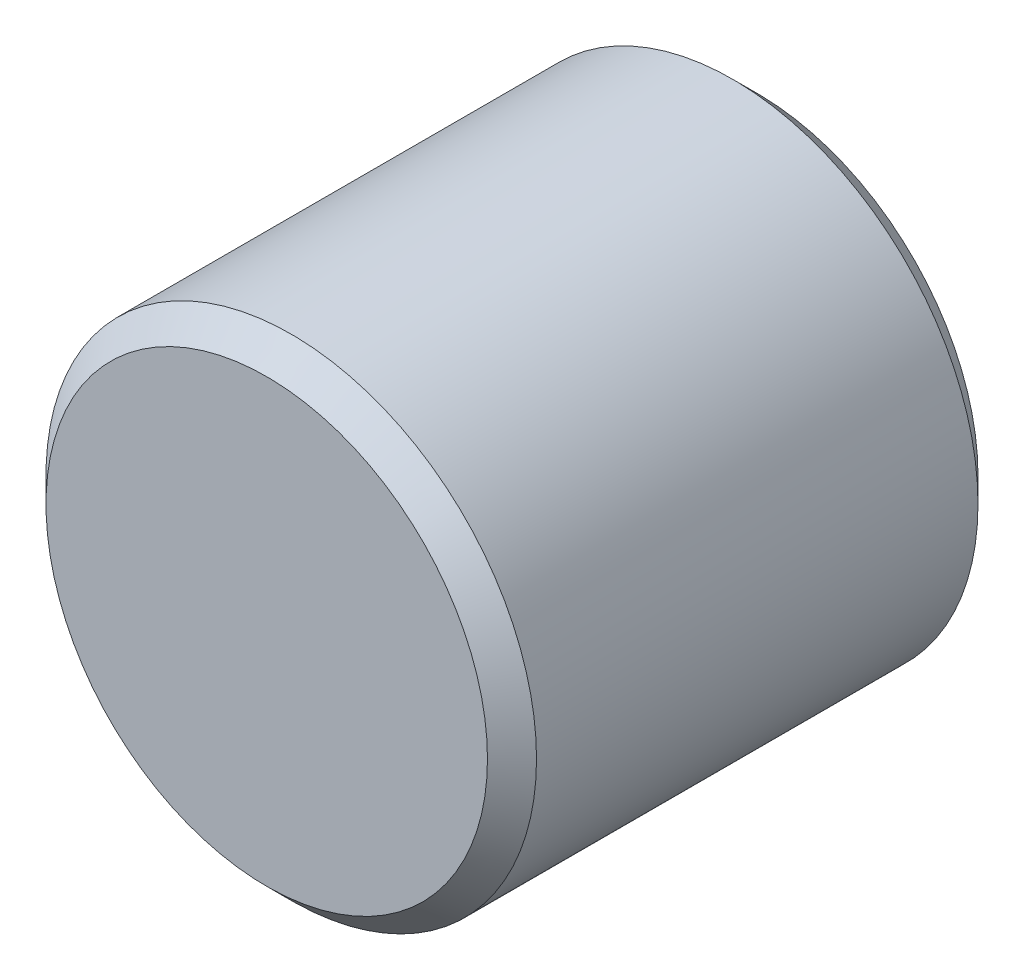
ISO-10303-21;
HEADER;
FILE_DESCRIPTION(('STEP AP214'),'2;1');
FILE_NAME('part.step','',(''),(''),'','','');
FILE_SCHEMA(('AUTOMOTIVE_DESIGN { 1 0 10303 214 1 1 1 1 }'));
ENDSEC;
DATA;
#1=APPLICATION_CONTEXT('core data for automotive mechanical design processes');
#2=APPLICATION_PROTOCOL_DEFINITION('international standard','automotive_design',2000,#1);
#3=PRODUCT_CONTEXT('',#1,'mechanical');
#4=PRODUCT('Part','Part','',(#3));
#5=PRODUCT_RELATED_PRODUCT_CATEGORY('part','',(#4));
#6=PRODUCT_DEFINITION_FORMATION('','',#4);
#7=PRODUCT_DEFINITION_CONTEXT('part definition',#1,'design');
#8=PRODUCT_DEFINITION('design','',#6,#7);
#9=PRODUCT_DEFINITION_SHAPE('','',#8);
#10=(LENGTH_UNIT() NAMED_UNIT(*) SI_UNIT(.MILLI.,.METRE.));
#11=(NAMED_UNIT(*) PLANE_ANGLE_UNIT() SI_UNIT($,.RADIAN.));
#12=(NAMED_UNIT(*) SI_UNIT($,.STERADIAN.) SOLID_ANGLE_UNIT());
#13=UNCERTAINTY_MEASURE_WITH_UNIT(LENGTH_MEASURE(1.E-05),#10,'distance_accuracy_value','');
#14=(GEOMETRIC_REPRESENTATION_CONTEXT(3) GLOBAL_UNCERTAINTY_ASSIGNED_CONTEXT((#13)) GLOBAL_UNIT_ASSIGNED_CONTEXT((#10,
#11,#12)) REPRESENTATION_CONTEXT('',''));
#15=CARTESIAN_POINT('',(0.,0.,0.));
#16=DIRECTION('',(0.,0.,1.));
#17=DIRECTION('',(1.,0.,0.));
#18=AXIS2_PLACEMENT_3D('',#15,#16,#17);
#19=CARTESIAN_POINT('',(0.,0.,2.54));
#20=DIRECTION('',(0.,0.,-1.));
#21=DIRECTION('',(-1.,0.,0.));
#22=AXIS2_PLACEMENT_3D('',#19,#20,#21);
#23=CYLINDRICAL_SURFACE('',#22,1.27);
#24=CARTESIAN_POINT('',(0.,0.,0.126999999999999));
#25=DIRECTION('',(0.,0.,1.));
#26=DIRECTION('',(1.,0.,0.));
#27=AXIS2_PLACEMENT_3D('',#24,#25,#26);
#28=CIRCLE('',#27,1.27);
#29=CARTESIAN_POINT('',(1.27,0.,0.126999999999999));
#30=VERTEX_POINT('',#29);
#31=EDGE_CURVE('E42',#30,#30,#28,.T.);
#32=ORIENTED_EDGE('',*,*,#31,.T.);
#33=EDGE_LOOP('',(#32));
#34=FACE_BOUND('',#33,.T.);
#35=CARTESIAN_POINT('',(0.,0.,2.413));
#36=DIRECTION('',(0.,0.,1.));
#37=DIRECTION('',(1.,0.,0.));
#38=AXIS2_PLACEMENT_3D('',#35,#36,#37);
#39=CIRCLE('',#38,1.27);
#40=CARTESIAN_POINT('',(1.27,0.,2.413));
#41=VERTEX_POINT('',#40);
#42=EDGE_CURVE('E46',#41,#41,#39,.F.);
#43=ORIENTED_EDGE('',*,*,#42,.T.);
#44=EDGE_LOOP('',(#43));
#45=FACE_BOUND('',#44,.T.);
#46=ADVANCED_FACE('F31',(#34,#45),#23,.T.);
#47=CARTESIAN_POINT('',(0.,0.,2.54));
#48=DIRECTION('',(0.,0.,1.));
#49=DIRECTION('',(1.,0.,0.));
#50=AXIS2_PLACEMENT_3D('',#47,#48,#49);
#51=PLANE('',#50);
#52=CARTESIAN_POINT('',(0.,0.,2.54));
#53=DIRECTION('',(0.,0.,1.));
#54=DIRECTION('',(1.,0.,0.));
#55=AXIS2_PLACEMENT_3D('',#52,#53,#54);
#56=CIRCLE('',#55,1.143);
#57=CARTESIAN_POINT('',(1.143,0.,2.54));
#58=VERTEX_POINT('',#57);
#59=EDGE_CURVE('E10',#58,#58,#56,.T.);
#60=ORIENTED_EDGE('',*,*,#59,.T.);
#61=EDGE_LOOP('',(#60));
#62=FACE_BOUND('',#61,.T.);
#63=ADVANCED_FACE('F62',(#62),#51,.T.);
#64=CARTESIAN_POINT('',(0.,0.,0.));
#65=DIRECTION('',(0.,0.,1.));
#66=DIRECTION('',(1.,0.,0.));
#67=AXIS2_PLACEMENT_3D('',#64,#65,#66);
#68=PLANE('',#67);
#69=CARTESIAN_POINT('',(0.,0.,0.));
#70=DIRECTION('',(0.,0.,1.));
#71=DIRECTION('',(1.,0.,0.));
#72=AXIS2_PLACEMENT_3D('',#69,#70,#71);
#73=CIRCLE('',#72,1.143);
#74=CARTESIAN_POINT('',(1.143,0.,0.));
#75=VERTEX_POINT('',#74);
#76=EDGE_CURVE('E38',#75,#75,#73,.F.);
#77=ORIENTED_EDGE('',*,*,#76,.T.);
#78=EDGE_LOOP('',(#77));
#79=FACE_BOUND('',#78,.T.);
#80=ADVANCED_FACE('F59',(#79),#68,.F.);
#81=CARTESIAN_POINT('',(0.,0.,0.126999999999999));
#82=DIRECTION('',(0.,0.,1.));
#83=DIRECTION('',(1.,0.,0.));
#84=AXIS2_PLACEMENT_3D('',#81,#82,#83);
#85=CONICAL_SURFACE('',#84,1.27,0.785398163397451);
#86=ORIENTED_EDGE('',*,*,#76,.F.);
#87=EDGE_LOOP('',(#86));
#88=FACE_BOUND('',#87,.T.);
#89=ORIENTED_EDGE('',*,*,#31,.F.);
#90=EDGE_LOOP('',(#89));
#91=FACE_BOUND('',#90,.T.);
#92=ADVANCED_FACE('F55',(#88,#91),#85,.T.);
#93=CARTESIAN_POINT('',(0.,0.,2.54));
#94=DIRECTION('',(0.,0.,-1.));
#95=DIRECTION('',(-1.,0.,0.));
#96=AXIS2_PLACEMENT_3D('',#93,#94,#95);
#97=CONICAL_SURFACE('',#96,1.143,0.785398163397449);
#98=ORIENTED_EDGE('',*,*,#42,.F.);
#99=EDGE_LOOP('',(#98));
#100=FACE_BOUND('',#99,.T.);
#101=ORIENTED_EDGE('',*,*,#59,.F.);
#102=EDGE_LOOP('',(#101));
#103=FACE_BOUND('',#102,.T.);
#104=ADVANCED_FACE('F33',(#100,#103),#97,.T.);
#105=CLOSED_SHELL('',(#46,#63,#80,#92,#104));
#106=MANIFOLD_SOLID_BREP('B2',#105);
#107=ADVANCED_BREP_SHAPE_REPRESENTATION('',(#18,#106),#14);
#108=SHAPE_DEFINITION_REPRESENTATION(#9,#107);
ENDSEC;
END-ISO-10303-21;
